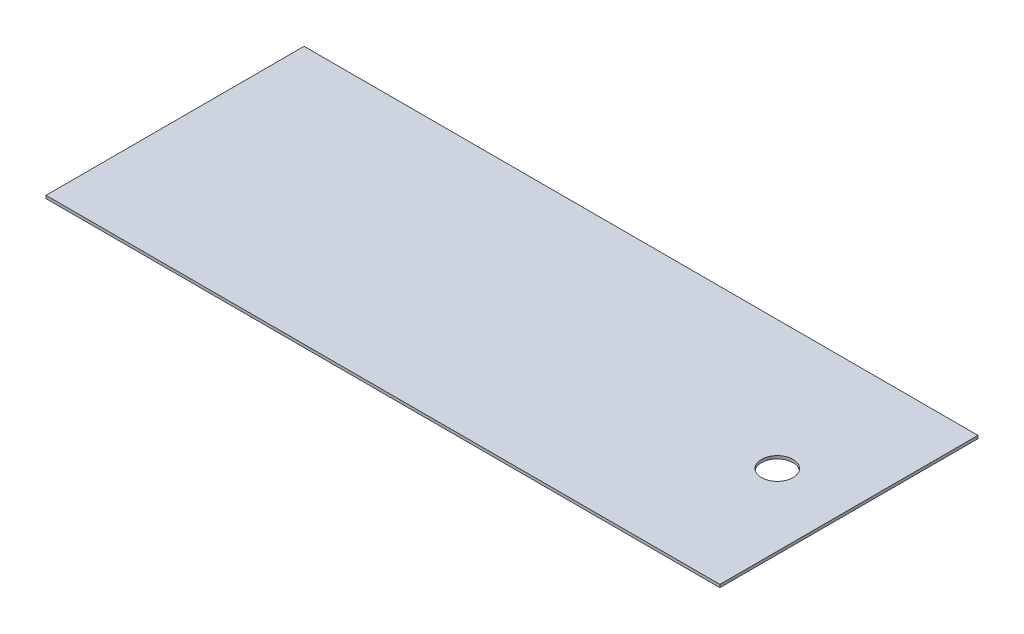
ISO-10303-21;
HEADER;
FILE_DESCRIPTION(('STEP AP214'),'2;1');
FILE_NAME('part.step','',(''),(''),'','','');
FILE_SCHEMA(('AUTOMOTIVE_DESIGN { 1 0 10303 214 1 1 1 1 }'));
ENDSEC;
DATA;
#1=APPLICATION_CONTEXT('core data for automotive mechanical design processes');
#2=APPLICATION_PROTOCOL_DEFINITION('international standard','automotive_design',2000,#1);
#3=PRODUCT_CONTEXT('',#1,'mechanical');
#4=PRODUCT('Part','Part','',(#3));
#5=PRODUCT_RELATED_PRODUCT_CATEGORY('part','',(#4));
#6=PRODUCT_DEFINITION_FORMATION('','',#4);
#7=PRODUCT_DEFINITION_CONTEXT('part definition',#1,'design');
#8=PRODUCT_DEFINITION('design','',#6,#7);
#9=PRODUCT_DEFINITION_SHAPE('','',#8);
#10=(LENGTH_UNIT() NAMED_UNIT(*) SI_UNIT(.MILLI.,.METRE.));
#11=(NAMED_UNIT(*) PLANE_ANGLE_UNIT() SI_UNIT($,.RADIAN.));
#12=(NAMED_UNIT(*) SI_UNIT($,.STERADIAN.) SOLID_ANGLE_UNIT());
#13=UNCERTAINTY_MEASURE_WITH_UNIT(LENGTH_MEASURE(1.E-05),#10,'distance_accuracy_value','');
#14=(GEOMETRIC_REPRESENTATION_CONTEXT(3) GLOBAL_UNCERTAINTY_ASSIGNED_CONTEXT((#13)) GLOBAL_UNIT_ASSIGNED_CONTEXT((#10,
#11,#12)) REPRESENTATION_CONTEXT('',''));
#15=CARTESIAN_POINT('',(0.,0.,0.));
#16=DIRECTION('',(0.,0.,1.));
#17=DIRECTION('',(1.,0.,0.));
#18=AXIS2_PLACEMENT_3D('',#15,#16,#17);
#19=CARTESIAN_POINT('',(235.,-2.,90.));
#20=DIRECTION('',(1.,0.,0.));
#21=DIRECTION('',(0.,0.,-1.));
#22=AXIS2_PLACEMENT_3D('',#19,#20,#21);
#23=PLANE('',#22);
#24=DIRECTION('',(0.,0.,-1.));
#25=VECTOR('',#24,1.);
#26=CARTESIAN_POINT('',(235.,0.,90.));
#27=LINE('',#26,#25);
#28=CARTESIAN_POINT('',(235.,0.,90.));
#29=VERTEX_POINT('',#28);
#30=CARTESIAN_POINT('',(235.,0.,-90.));
#31=VERTEX_POINT('',#30);
#32=EDGE_CURVE('E103',#29,#31,#27,.T.);
#33=ORIENTED_EDGE('',*,*,#32,.F.);
#34=DIRECTION('',(0.,1.,0.));
#35=VECTOR('',#34,1.);
#36=CARTESIAN_POINT('',(235.,-2.,90.));
#37=LINE('',#36,#35);
#38=CARTESIAN_POINT('',(235.,-2.,90.));
#39=VERTEX_POINT('',#38);
#40=EDGE_CURVE('E11',#39,#29,#37,.T.);
#41=ORIENTED_EDGE('',*,*,#40,.F.);
#42=DIRECTION('',(0.,0.,-1.));
#43=VECTOR('',#42,1.);
#44=CARTESIAN_POINT('',(235.,-2.,90.));
#45=LINE('',#44,#43);
#46=CARTESIAN_POINT('',(235.,-2.,-90.));
#47=VERTEX_POINT('',#46);
#48=EDGE_CURVE('E96',#39,#47,#45,.T.);
#49=ORIENTED_EDGE('',*,*,#48,.T.);
#50=DIRECTION('',(0.,1.,0.));
#51=VECTOR('',#50,1.);
#52=CARTESIAN_POINT('',(235.,-2.,-90.));
#53=LINE('',#52,#51);
#54=EDGE_CURVE('E41',#47,#31,#53,.T.);
#55=ORIENTED_EDGE('',*,*,#54,.T.);
#56=EDGE_LOOP('',(#33,#41,#49,#55));
#57=FACE_BOUND('',#56,.T.);
#58=ADVANCED_FACE('F38',(#57),#23,.T.);
#59=CARTESIAN_POINT('',(-235.,-2.,90.));
#60=DIRECTION('',(0.,0.,1.));
#61=DIRECTION('',(1.,0.,0.));
#62=AXIS2_PLACEMENT_3D('',#59,#60,#61);
#63=PLANE('',#62);
#64=DIRECTION('',(1.,0.,0.));
#65=VECTOR('',#64,1.);
#66=CARTESIAN_POINT('',(-235.,0.,90.));
#67=LINE('',#66,#65);
#68=CARTESIAN_POINT('',(-235.,0.,90.));
#69=VERTEX_POINT('',#68);
#70=EDGE_CURVE('E98',#69,#29,#67,.T.);
#71=ORIENTED_EDGE('',*,*,#70,.F.);
#72=DIRECTION('',(0.,1.,0.));
#73=VECTOR('',#72,1.);
#74=CARTESIAN_POINT('',(-235.,-2.,90.));
#75=LINE('',#74,#73);
#76=CARTESIAN_POINT('',(-235.,-2.,90.));
#77=VERTEX_POINT('',#76);
#78=EDGE_CURVE('E47',#77,#69,#75,.T.);
#79=ORIENTED_EDGE('',*,*,#78,.F.);
#80=DIRECTION('',(1.,0.,0.));
#81=VECTOR('',#80,1.);
#82=CARTESIAN_POINT('',(-235.,-2.,90.));
#83=LINE('',#82,#81);
#84=EDGE_CURVE('E93',#77,#39,#83,.T.);
#85=ORIENTED_EDGE('',*,*,#84,.T.);
#86=ORIENTED_EDGE('',*,*,#40,.T.);
#87=EDGE_LOOP('',(#71,#79,#85,#86));
#88=FACE_BOUND('',#87,.T.);
#89=ADVANCED_FACE('F114',(#88),#63,.T.);
#90=CARTESIAN_POINT('',(-235.,-2.,90.));
#91=DIRECTION('',(-1.,0.,0.));
#92=DIRECTION('',(0.,0.,1.));
#93=AXIS2_PLACEMENT_3D('',#90,#91,#92);
#94=PLANE('',#93);
#95=DIRECTION('',(0.,0.,1.));
#96=VECTOR('',#95,1.);
#97=CARTESIAN_POINT('',(-235.,0.,90.));
#98=LINE('',#97,#96);
#99=CARTESIAN_POINT('',(-235.,0.,-90.));
#100=VERTEX_POINT('',#99);
#101=EDGE_CURVE('E88',#100,#69,#98,.T.);
#102=ORIENTED_EDGE('',*,*,#101,.F.);
#103=DIRECTION('',(0.,1.,0.));
#104=VECTOR('',#103,1.);
#105=CARTESIAN_POINT('',(-235.,-2.,-90.));
#106=LINE('',#105,#104);
#107=CARTESIAN_POINT('',(-235.,-2.,-90.));
#108=VERTEX_POINT('',#107);
#109=EDGE_CURVE('E83',#108,#100,#106,.T.);
#110=ORIENTED_EDGE('',*,*,#109,.F.);
#111=DIRECTION('',(0.,0.,1.));
#112=VECTOR('',#111,1.);
#113=CARTESIAN_POINT('',(-235.,-2.,90.));
#114=LINE('',#113,#112);
#115=EDGE_CURVE('E86',#108,#77,#114,.T.);
#116=ORIENTED_EDGE('',*,*,#115,.T.);
#117=ORIENTED_EDGE('',*,*,#78,.T.);
#118=EDGE_LOOP('',(#102,#110,#116,#117));
#119=FACE_BOUND('',#118,.T.);
#120=ADVANCED_FACE('F85',(#119),#94,.T.);
#121=CARTESIAN_POINT('',(-235.,-2.,-90.));
#122=DIRECTION('',(0.,0.,-1.));
#123=DIRECTION('',(-1.,0.,0.));
#124=AXIS2_PLACEMENT_3D('',#121,#122,#123);
#125=PLANE('',#124);
#126=DIRECTION('',(-1.,0.,0.));
#127=VECTOR('',#126,1.);
#128=CARTESIAN_POINT('',(-235.,0.,-90.));
#129=LINE('',#128,#127);
#130=EDGE_CURVE('E106',#31,#100,#129,.T.);
#131=ORIENTED_EDGE('',*,*,#130,.F.);
#132=ORIENTED_EDGE('',*,*,#54,.F.);
#133=DIRECTION('',(-1.,0.,0.));
#134=VECTOR('',#133,1.);
#135=CARTESIAN_POINT('',(-235.,-2.,-90.));
#136=LINE('',#135,#134);
#137=EDGE_CURVE('E92',#47,#108,#136,.T.);
#138=ORIENTED_EDGE('',*,*,#137,.T.);
#139=ORIENTED_EDGE('',*,*,#109,.T.);
#140=EDGE_LOOP('',(#131,#132,#138,#139));
#141=FACE_BOUND('',#140,.T.);
#142=ADVANCED_FACE('F95',(#141),#125,.T.);
#143=CARTESIAN_POINT('',(0.,-2.,0.));
#144=DIRECTION('',(0.,-1.,0.));
#145=DIRECTION('',(0.,0.,-1.));
#146=AXIS2_PLACEMENT_3D('',#143,#144,#145);
#147=PLANE('',#146);
#148=CARTESIAN_POINT('',(185.,-2.,0.));
#149=DIRECTION('',(0.,1.,0.));
#150=DIRECTION('',(0.,0.,1.));
#151=AXIS2_PLACEMENT_3D('',#148,#149,#150);
#152=CIRCLE('',#151,11.);
#153=CARTESIAN_POINT('',(185.,-2.,11.));
#154=VERTEX_POINT('',#153);
#155=EDGE_CURVE('E107',#154,#154,#152,.T.);
#156=ORIENTED_EDGE('',*,*,#155,.T.);
#157=EDGE_LOOP('',(#156));
#158=FACE_BOUND('',#157,.T.);
#159=ORIENTED_EDGE('',*,*,#48,.F.);
#160=ORIENTED_EDGE('',*,*,#84,.F.);
#161=ORIENTED_EDGE('',*,*,#115,.F.);
#162=ORIENTED_EDGE('',*,*,#137,.F.);
#163=EDGE_LOOP('',(#159,#160,#161,#162));
#164=FACE_BOUND('',#163,.T.);
#165=ADVANCED_FACE('F91',(#158,#164),#147,.T.);
#166=CARTESIAN_POINT('',(0.,0.,0.));
#167=DIRECTION('',(0.,-1.,0.));
#168=DIRECTION('',(0.,0.,-1.));
#169=AXIS2_PLACEMENT_3D('',#166,#167,#168);
#170=PLANE('',#169);
#171=CARTESIAN_POINT('',(185.,0.,0.));
#172=DIRECTION('',(0.,1.,0.));
#173=DIRECTION('',(0.,0.,1.));
#174=AXIS2_PLACEMENT_3D('',#171,#172,#173);
#175=CIRCLE('',#174,11.);
#176=CARTESIAN_POINT('',(185.,0.,11.));
#177=VERTEX_POINT('',#176);
#178=EDGE_CURVE('E144',#177,#177,#175,.T.);
#179=ORIENTED_EDGE('',*,*,#178,.F.);
#180=EDGE_LOOP('',(#179));
#181=FACE_BOUND('',#180,.T.);
#182=ORIENTED_EDGE('',*,*,#32,.T.);
#183=ORIENTED_EDGE('',*,*,#130,.T.);
#184=ORIENTED_EDGE('',*,*,#101,.T.);
#185=ORIENTED_EDGE('',*,*,#70,.T.);
#186=EDGE_LOOP('',(#182,#183,#184,#185));
#187=FACE_BOUND('',#186,.T.);
#188=ADVANCED_FACE('F113',(#181,#187),#170,.F.);
#189=CARTESIAN_POINT('',(185.,-2.,0.));
#190=DIRECTION('',(0.,1.,0.));
#191=DIRECTION('',(0.,0.,1.));
#192=AXIS2_PLACEMENT_3D('',#189,#190,#191);
#193=CYLINDRICAL_SURFACE('',#192,11.);
#194=ORIENTED_EDGE('',*,*,#155,.F.);
#195=EDGE_LOOP('',(#194));
#196=FACE_BOUND('',#195,.T.);
#197=ORIENTED_EDGE('',*,*,#178,.T.);
#198=EDGE_LOOP('',(#197));
#199=FACE_BOUND('',#198,.T.);
#200=ADVANCED_FACE('F132',(#196,#199),#193,.F.);
#201=CLOSED_SHELL('',(#58,#89,#120,#142,#165,#188,#200));
#202=MANIFOLD_SOLID_BREP('B2',#201);
#203=ADVANCED_BREP_SHAPE_REPRESENTATION('',(#18,#202),#14);
#204=SHAPE_DEFINITION_REPRESENTATION(#9,#203);
ENDSEC;
END-ISO-10303-21;
